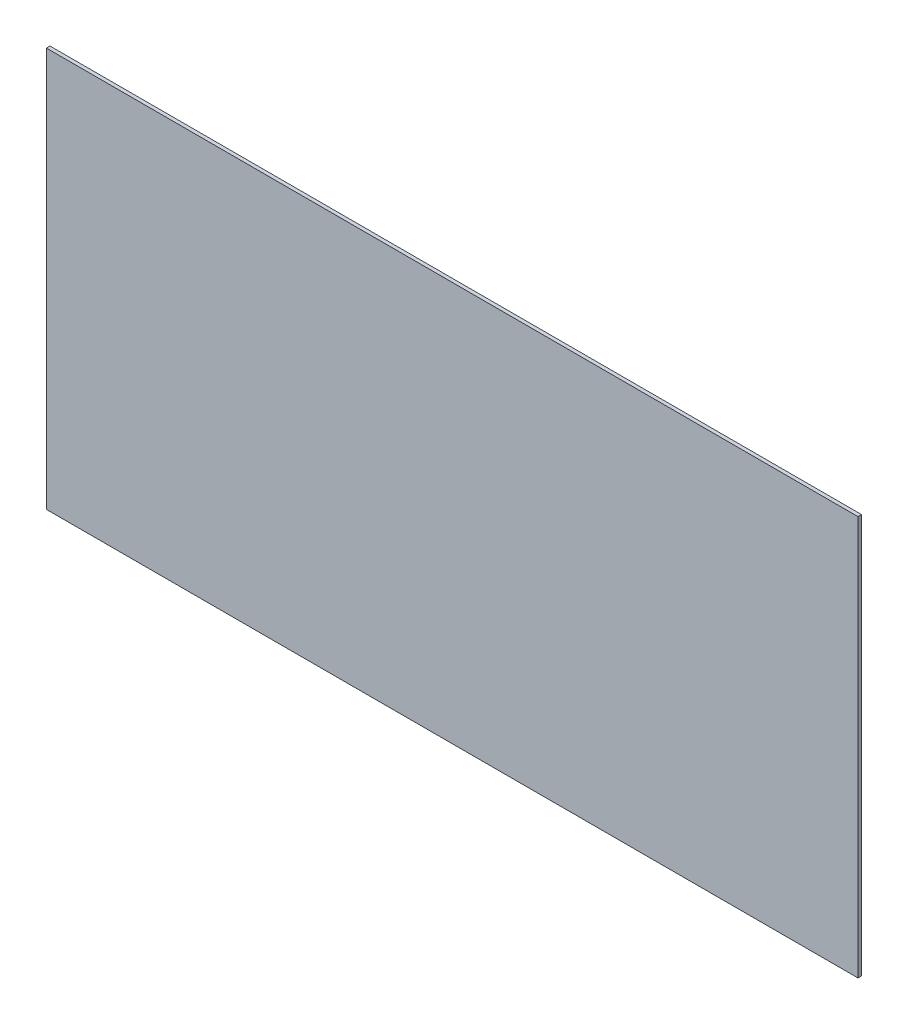
ISO-10303-21;
HEADER;
FILE_DESCRIPTION(('STEP AP214'),'2;1');
FILE_NAME('part.step','',(''),(''),'','','');
FILE_SCHEMA(('AUTOMOTIVE_DESIGN { 1 0 10303 214 1 1 1 1 }'));
ENDSEC;
DATA;
#1=APPLICATION_CONTEXT('core data for automotive mechanical design processes');
#2=APPLICATION_PROTOCOL_DEFINITION('international standard','automotive_design',2000,#1);
#3=PRODUCT_CONTEXT('',#1,'mechanical');
#4=PRODUCT('Part','Part','',(#3));
#5=PRODUCT_RELATED_PRODUCT_CATEGORY('part','',(#4));
#6=PRODUCT_DEFINITION_FORMATION('','',#4);
#7=PRODUCT_DEFINITION_CONTEXT('part definition',#1,'design');
#8=PRODUCT_DEFINITION('design','',#6,#7);
#9=PRODUCT_DEFINITION_SHAPE('','',#8);
#10=(LENGTH_UNIT() NAMED_UNIT(*) SI_UNIT(.MILLI.,.METRE.));
#11=(NAMED_UNIT(*) PLANE_ANGLE_UNIT() SI_UNIT($,.RADIAN.));
#12=(NAMED_UNIT(*) SI_UNIT($,.STERADIAN.) SOLID_ANGLE_UNIT());
#13=UNCERTAINTY_MEASURE_WITH_UNIT(LENGTH_MEASURE(1.E-05),#10,'distance_accuracy_value','');
#14=(GEOMETRIC_REPRESENTATION_CONTEXT(3) GLOBAL_UNCERTAINTY_ASSIGNED_CONTEXT((#13)) GLOBAL_UNIT_ASSIGNED_CONTEXT((#10,
#11,#12)) REPRESENTATION_CONTEXT('',''));
#15=CARTESIAN_POINT('',(0.,0.,0.));
#16=DIRECTION('',(0.,0.,1.));
#17=DIRECTION('',(1.,0.,0.));
#18=AXIS2_PLACEMENT_3D('',#15,#16,#17);
#19=CARTESIAN_POINT('',(-2.88925,1.4224,0.0254));
#20=DIRECTION('',(0.,0.,1.));
#21=DIRECTION('',(1.,0.,0.));
#22=AXIS2_PLACEMENT_3D('',#19,#20,#21);
#23=PLANE('',#22);
#24=DIRECTION('',(0.,1.,0.));
#25=VECTOR('',#24,1.);
#26=CARTESIAN_POINT('',(2.88925,1.4224,0.0254));
#27=LINE('',#26,#25);
#28=CARTESIAN_POINT('',(2.88925,1.4224,0.0254));
#29=VERTEX_POINT('',#28);
#30=CARTESIAN_POINT('',(2.88925,-1.4224,0.0254));
#31=VERTEX_POINT('',#30);
#32=EDGE_CURVE('E53',#29,#31,#27,.F.);
#33=ORIENTED_EDGE('',*,*,#32,.F.);
#34=DIRECTION('',(1.,0.,0.));
#35=VECTOR('',#34,1.);
#36=CARTESIAN_POINT('',(-2.88925,1.4224,0.0254));
#37=LINE('',#36,#35);
#38=CARTESIAN_POINT('',(-2.88925,1.4224,0.0254));
#39=VERTEX_POINT('',#38);
#40=EDGE_CURVE('E68',#39,#29,#37,.T.);
#41=ORIENTED_EDGE('',*,*,#40,.F.);
#42=DIRECTION('',(0.,1.,0.));
#43=VECTOR('',#42,1.);
#44=CARTESIAN_POINT('',(-2.88925,-1.4224,0.0254));
#45=LINE('',#44,#43);
#46=CARTESIAN_POINT('',(-2.88925,-1.4224,0.0254));
#47=VERTEX_POINT('',#46);
#48=EDGE_CURVE('E20',#47,#39,#45,.T.);
#49=ORIENTED_EDGE('',*,*,#48,.F.);
#50=DIRECTION('',(1.,0.,0.));
#51=VECTOR('',#50,1.);
#52=CARTESIAN_POINT('',(2.88925,-1.4224,0.0254));
#53=LINE('',#52,#51);
#54=EDGE_CURVE('E58',#31,#47,#53,.F.);
#55=ORIENTED_EDGE('',*,*,#54,.F.);
#56=EDGE_LOOP('',(#33,#41,#49,#55));
#57=FACE_BOUND('',#56,.T.);
#58=ADVANCED_FACE('F17',(#57),#23,.T.);
#59=CARTESIAN_POINT('',(-2.88925,-1.4224,0.));
#60=DIRECTION('',(-1.,0.,0.));
#61=DIRECTION('',(0.,0.,1.));
#62=AXIS2_PLACEMENT_3D('',#59,#60,#61);
#63=PLANE('',#62);
#64=DIRECTION('',(0.,0.,1.));
#65=VECTOR('',#64,1.);
#66=CARTESIAN_POINT('',(-2.88925,1.4224,0.));
#67=LINE('',#66,#65);
#68=CARTESIAN_POINT('',(-2.88925,1.4224,0.));
#69=VERTEX_POINT('',#68);
#70=EDGE_CURVE('E79',#69,#39,#67,.T.);
#71=ORIENTED_EDGE('',*,*,#70,.F.);
#72=DIRECTION('',(0.,1.,0.));
#73=VECTOR('',#72,1.);
#74=CARTESIAN_POINT('',(-2.88925,1.4224,0.));
#75=LINE('',#74,#73);
#76=CARTESIAN_POINT('',(-2.88925,-1.4224,0.));
#77=VERTEX_POINT('',#76);
#78=EDGE_CURVE('E74',#69,#77,#75,.F.);
#79=ORIENTED_EDGE('',*,*,#78,.T.);
#80=DIRECTION('',(0.,0.,-1.));
#81=VECTOR('',#80,1.);
#82=CARTESIAN_POINT('',(-2.88925,-1.4224,0.));
#83=LINE('',#82,#81);
#84=EDGE_CURVE('E63',#47,#77,#83,.T.);
#85=ORIENTED_EDGE('',*,*,#84,.F.);
#86=ORIENTED_EDGE('',*,*,#48,.T.);
#87=EDGE_LOOP('',(#71,#79,#85,#86));
#88=FACE_BOUND('',#87,.T.);
#89=ADVANCED_FACE('F73',(#88),#63,.T.);
#90=CARTESIAN_POINT('',(2.88925,-1.4224,0.));
#91=DIRECTION('',(0.,-1.,0.));
#92=DIRECTION('',(0.,0.,-1.));
#93=AXIS2_PLACEMENT_3D('',#90,#91,#92);
#94=PLANE('',#93);
#95=ORIENTED_EDGE('',*,*,#84,.T.);
#96=DIRECTION('',(1.,0.,0.));
#97=VECTOR('',#96,1.);
#98=CARTESIAN_POINT('',(-2.88925,-1.4224,0.));
#99=LINE('',#98,#97);
#100=CARTESIAN_POINT('',(2.88925,-1.4224,0.));
#101=VERTEX_POINT('',#100);
#102=EDGE_CURVE('E84',#77,#101,#99,.T.);
#103=ORIENTED_EDGE('',*,*,#102,.T.);
#104=DIRECTION('',(0.,0.,-1.));
#105=VECTOR('',#104,1.);
#106=CARTESIAN_POINT('',(2.88925,-1.4224,0.));
#107=LINE('',#106,#105);
#108=EDGE_CURVE('E65',#31,#101,#107,.T.);
#109=ORIENTED_EDGE('',*,*,#108,.F.);
#110=ORIENTED_EDGE('',*,*,#54,.T.);
#111=EDGE_LOOP('',(#95,#103,#109,#110));
#112=FACE_BOUND('',#111,.T.);
#113=ADVANCED_FACE('F60',(#112),#94,.T.);
#114=CARTESIAN_POINT('',(2.88925,1.4224,0.));
#115=DIRECTION('',(1.,0.,0.));
#116=DIRECTION('',(0.,0.,-1.));
#117=AXIS2_PLACEMENT_3D('',#114,#115,#116);
#118=PLANE('',#117);
#119=ORIENTED_EDGE('',*,*,#108,.T.);
#120=DIRECTION('',(0.,1.,0.));
#121=VECTOR('',#120,1.);
#122=CARTESIAN_POINT('',(2.88925,1.4224,0.));
#123=LINE('',#122,#121);
#124=CARTESIAN_POINT('',(2.88925,1.4224,0.));
#125=VERTEX_POINT('',#124);
#126=EDGE_CURVE('E26',#101,#125,#123,.T.);
#127=ORIENTED_EDGE('',*,*,#126,.T.);
#128=DIRECTION('',(0.,0.,1.));
#129=VECTOR('',#128,1.);
#130=CARTESIAN_POINT('',(2.88925,1.4224,0.));
#131=LINE('',#130,#129);
#132=EDGE_CURVE('E34',#29,#125,#131,.F.);
#133=ORIENTED_EDGE('',*,*,#132,.F.);
#134=ORIENTED_EDGE('',*,*,#32,.T.);
#135=EDGE_LOOP('',(#119,#127,#133,#134));
#136=FACE_BOUND('',#135,.T.);
#137=ADVANCED_FACE('F88',(#136),#118,.T.);
#138=CARTESIAN_POINT('',(-2.88925,1.4224,0.));
#139=DIRECTION('',(0.,1.,0.));
#140=DIRECTION('',(0.,0.,1.));
#141=AXIS2_PLACEMENT_3D('',#138,#139,#140);
#142=PLANE('',#141);
#143=ORIENTED_EDGE('',*,*,#132,.T.);
#144=DIRECTION('',(1.,0.,0.));
#145=VECTOR('',#144,1.);
#146=CARTESIAN_POINT('',(-2.88925,1.4224,0.));
#147=LINE('',#146,#145);
#148=EDGE_CURVE('E11',#125,#69,#147,.F.);
#149=ORIENTED_EDGE('',*,*,#148,.T.);
#150=ORIENTED_EDGE('',*,*,#70,.T.);
#151=ORIENTED_EDGE('',*,*,#40,.T.);
#152=EDGE_LOOP('',(#143,#149,#150,#151));
#153=FACE_BOUND('',#152,.T.);
#154=ADVANCED_FACE('F91',(#153),#142,.T.);
#155=CARTESIAN_POINT('',(-2.88925,1.4224,0.));
#156=DIRECTION('',(0.,0.,1.));
#157=DIRECTION('',(1.,0.,0.));
#158=AXIS2_PLACEMENT_3D('',#155,#156,#157);
#159=PLANE('',#158);
#160=ORIENTED_EDGE('',*,*,#126,.F.);
#161=ORIENTED_EDGE('',*,*,#102,.F.);
#162=ORIENTED_EDGE('',*,*,#78,.F.);
#163=ORIENTED_EDGE('',*,*,#148,.F.);
#164=EDGE_LOOP('',(#160,#161,#162,#163));
#165=FACE_BOUND('',#164,.T.);
#166=ADVANCED_FACE('F90',(#165),#159,.F.);
#167=CLOSED_SHELL('',(#58,#89,#113,#137,#154,#166));
#168=MANIFOLD_SOLID_BREP('B1',#167);
#169=ADVANCED_BREP_SHAPE_REPRESENTATION('',(#18,#168),#14);
#170=SHAPE_DEFINITION_REPRESENTATION(#9,#169);
ENDSEC;
END-ISO-10303-21;
